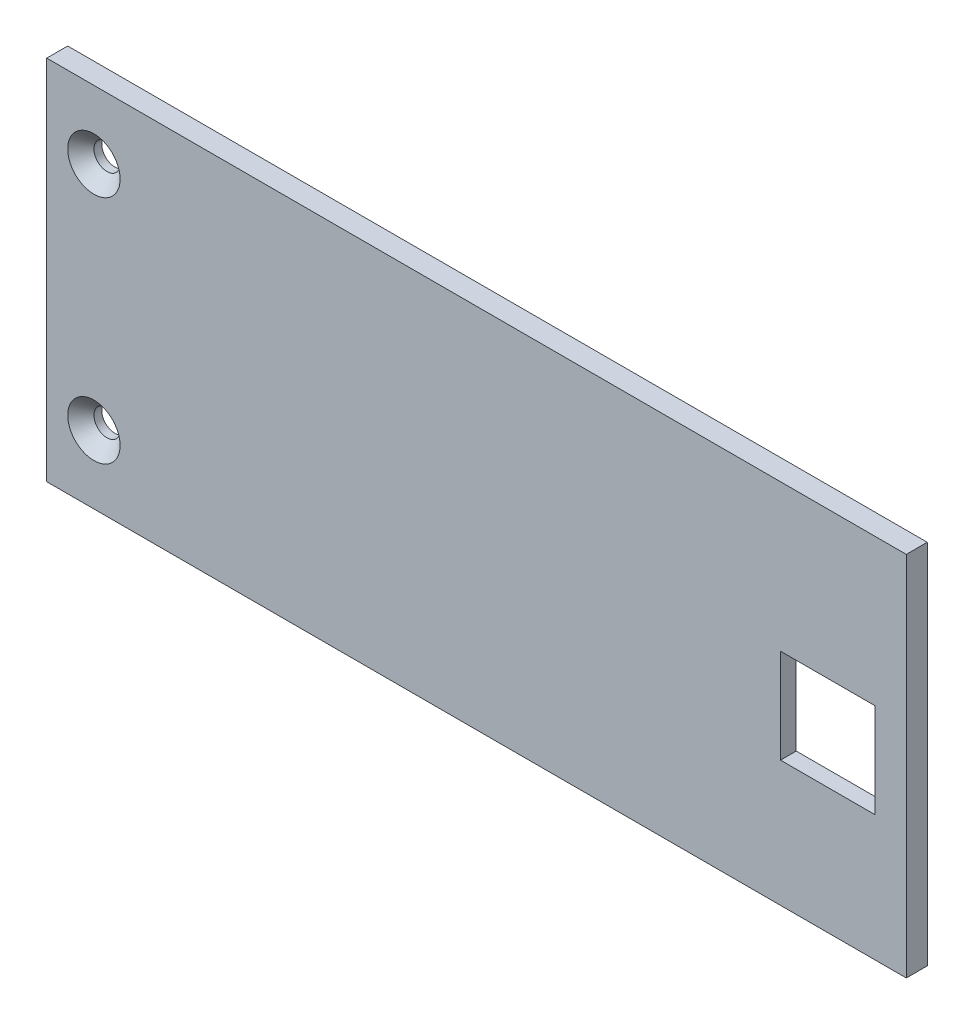
ISO-10303-21;
HEADER;
FILE_DESCRIPTION(('STEP AP214'),'2;1');
FILE_NAME('part.step','',(''),(''),'','','');
FILE_SCHEMA(('AUTOMOTIVE_DESIGN { 1 0 10303 214 1 1 1 1 }'));
ENDSEC;
DATA;
#1=APPLICATION_CONTEXT('core data for automotive mechanical design processes');
#2=APPLICATION_PROTOCOL_DEFINITION('international standard','automotive_design',2000,#1);
#3=PRODUCT_CONTEXT('',#1,'mechanical');
#4=PRODUCT('Part','Part','',(#3));
#5=PRODUCT_RELATED_PRODUCT_CATEGORY('part','',(#4));
#6=PRODUCT_DEFINITION_FORMATION('','',#4);
#7=PRODUCT_DEFINITION_CONTEXT('part definition',#1,'design');
#8=PRODUCT_DEFINITION('design','',#6,#7);
#9=PRODUCT_DEFINITION_SHAPE('','',#8);
#10=(LENGTH_UNIT() NAMED_UNIT(*) SI_UNIT(.MILLI.,.METRE.));
#11=(NAMED_UNIT(*) PLANE_ANGLE_UNIT() SI_UNIT($,.RADIAN.));
#12=(NAMED_UNIT(*) SI_UNIT($,.STERADIAN.) SOLID_ANGLE_UNIT());
#13=UNCERTAINTY_MEASURE_WITH_UNIT(LENGTH_MEASURE(1.E-05),#10,'distance_accuracy_value','');
#14=(GEOMETRIC_REPRESENTATION_CONTEXT(3) GLOBAL_UNCERTAINTY_ASSIGNED_CONTEXT((#13)) GLOBAL_UNIT_ASSIGNED_CONTEXT((#10,
#11,#12)) REPRESENTATION_CONTEXT('',''));
#15=CARTESIAN_POINT('',(0.,0.,0.));
#16=DIRECTION('',(0.,0.,1.));
#17=DIRECTION('',(1.,0.,0.));
#18=AXIS2_PLACEMENT_3D('',#15,#16,#17);
#19=CARTESIAN_POINT('',(-12.,12.,2.));
#20=DIRECTION('',(0.,1.,0.));
#21=DIRECTION('',(0.,0.,1.));
#22=AXIS2_PLACEMENT_3D('',#19,#20,#21);
#23=PLANE('',#22);
#24=DIRECTION('',(0.,0.,-1.));
#25=VECTOR('',#24,1.);
#26=CARTESIAN_POINT('',(-3.,12.,2.));
#27=LINE('',#26,#25);
#28=CARTESIAN_POINT('',(-3.,12.,2.));
#29=VERTEX_POINT('',#28);
#30=CARTESIAN_POINT('',(-3.,12.,0.5));
#31=VERTEX_POINT('',#30);
#32=EDGE_CURVE('E182',#29,#31,#27,.T.);
#33=ORIENTED_EDGE('',*,*,#32,.T.);
#34=DIRECTION('',(-1.,0.,0.));
#35=VECTOR('',#34,1.);
#36=CARTESIAN_POINT('',(-12.,12.,0.5));
#37=LINE('',#36,#35);
#38=CARTESIAN_POINT('',(-12.,12.,0.5));
#39=VERTEX_POINT('',#38);
#40=EDGE_CURVE('E158',#31,#39,#37,.T.);
#41=ORIENTED_EDGE('',*,*,#40,.T.);
#42=DIRECTION('',(0.,0.,-1.));
#43=VECTOR('',#42,1.);
#44=CARTESIAN_POINT('',(-12.,12.,2.));
#45=LINE('',#44,#43);
#46=CARTESIAN_POINT('',(-12.,12.,2.));
#47=VERTEX_POINT('',#46);
#48=EDGE_CURVE('E185',#47,#39,#45,.T.);
#49=ORIENTED_EDGE('',*,*,#48,.F.);
#50=DIRECTION('',(1.,0.,0.));
#51=VECTOR('',#50,1.);
#52=CARTESIAN_POINT('',(-12.,12.,2.));
#53=LINE('',#52,#51);
#54=EDGE_CURVE('E169',#47,#29,#53,.T.);
#55=ORIENTED_EDGE('',*,*,#54,.T.);
#56=EDGE_LOOP('',(#33,#41,#49,#55));
#57=FACE_BOUND('',#56,.T.);
#58=ADVANCED_FACE('F26',(#57),#23,.T.);
#59=CARTESIAN_POINT('',(-3.,21.,2.));
#60=DIRECTION('',(-1.,0.,0.));
#61=DIRECTION('',(0.,-1.,0.));
#62=AXIS2_PLACEMENT_3D('',#59,#60,#61);
#63=PLANE('',#62);
#64=DIRECTION('',(0.,0.,-1.));
#65=VECTOR('',#64,1.);
#66=CARTESIAN_POINT('',(-3.,21.,2.));
#67=LINE('',#66,#65);
#68=CARTESIAN_POINT('',(-3.,21.,2.));
#69=VERTEX_POINT('',#68);
#70=CARTESIAN_POINT('',(-3.,21.,0.5));
#71=VERTEX_POINT('',#70);
#72=EDGE_CURVE('E179',#69,#71,#67,.T.);
#73=ORIENTED_EDGE('',*,*,#72,.T.);
#74=DIRECTION('',(0.,-1.,0.));
#75=VECTOR('',#74,1.);
#76=CARTESIAN_POINT('',(-3.,21.,0.5));
#77=LINE('',#76,#75);
#78=EDGE_CURVE('E155',#71,#31,#77,.T.);
#79=ORIENTED_EDGE('',*,*,#78,.T.);
#80=ORIENTED_EDGE('',*,*,#32,.F.);
#81=DIRECTION('',(0.,1.,0.));
#82=VECTOR('',#81,1.);
#83=CARTESIAN_POINT('',(-3.,21.,2.));
#84=LINE('',#83,#82);
#85=EDGE_CURVE('E171',#29,#69,#84,.T.);
#86=ORIENTED_EDGE('',*,*,#85,.T.);
#87=EDGE_LOOP('',(#73,#79,#80,#86));
#88=FACE_BOUND('',#87,.T.);
#89=ADVANCED_FACE('F249',(#88),#63,.T.);
#90=CARTESIAN_POINT('',(-12.,21.,2.));
#91=DIRECTION('',(0.,-1.,0.));
#92=DIRECTION('',(1.,0.,0.));
#93=AXIS2_PLACEMENT_3D('',#90,#91,#92);
#94=PLANE('',#93);
#95=DIRECTION('',(0.,0.,-1.));
#96=VECTOR('',#95,1.);
#97=CARTESIAN_POINT('',(-12.,21.,2.));
#98=LINE('',#97,#96);
#99=CARTESIAN_POINT('',(-12.,21.,2.));
#100=VERTEX_POINT('',#99);
#101=CARTESIAN_POINT('',(-12.,21.,0.5));
#102=VERTEX_POINT('',#101);
#103=EDGE_CURVE('E176',#100,#102,#98,.T.);
#104=ORIENTED_EDGE('',*,*,#103,.T.);
#105=DIRECTION('',(1.,0.,0.));
#106=VECTOR('',#105,1.);
#107=CARTESIAN_POINT('',(-12.,21.,0.5));
#108=LINE('',#107,#106);
#109=EDGE_CURVE('E49',#102,#71,#108,.T.);
#110=ORIENTED_EDGE('',*,*,#109,.T.);
#111=ORIENTED_EDGE('',*,*,#72,.F.);
#112=DIRECTION('',(-1.,0.,0.));
#113=VECTOR('',#112,1.);
#114=CARTESIAN_POINT('',(-12.,21.,2.));
#115=LINE('',#114,#113);
#116=EDGE_CURVE('E173',#69,#100,#115,.T.);
#117=ORIENTED_EDGE('',*,*,#116,.T.);
#118=EDGE_LOOP('',(#104,#110,#111,#117));
#119=FACE_BOUND('',#118,.T.);
#120=ADVANCED_FACE('F255',(#119),#94,.T.);
#121=CARTESIAN_POINT('',(-12.,21.,2.));
#122=DIRECTION('',(1.,0.,0.));
#123=DIRECTION('',(0.,1.,0.));
#124=AXIS2_PLACEMENT_3D('',#121,#122,#123);
#125=PLANE('',#124);
#126=ORIENTED_EDGE('',*,*,#48,.T.);
#127=DIRECTION('',(0.,1.,0.));
#128=VECTOR('',#127,1.);
#129=CARTESIAN_POINT('',(-12.,21.,0.5));
#130=LINE('',#129,#128);
#131=EDGE_CURVE('E11',#39,#102,#130,.T.);
#132=ORIENTED_EDGE('',*,*,#131,.T.);
#133=ORIENTED_EDGE('',*,*,#103,.F.);
#134=DIRECTION('',(0.,-1.,0.));
#135=VECTOR('',#134,1.);
#136=CARTESIAN_POINT('',(-12.,16.5,2.));
#137=LINE('',#136,#135);
#138=EDGE_CURVE('E167',#100,#47,#137,.T.);
#139=ORIENTED_EDGE('',*,*,#138,.T.);
#140=EDGE_LOOP('',(#126,#132,#133,#139));
#141=FACE_BOUND('',#140,.T.);
#142=ADVANCED_FACE('F265',(#141),#125,.T.);
#143=CARTESIAN_POINT('',(0.,35.,2.));
#144=DIRECTION('',(0.,0.,1.));
#145=DIRECTION('',(1.,0.,0.));
#146=AXIS2_PLACEMENT_3D('',#143,#144,#145);
#147=PLANE('',#146);
#148=CARTESIAN_POINT('',(-77.5,6.5,2.));
#149=DIRECTION('',(0.,0.,1.));
#150=DIRECTION('',(1.,0.,0.));
#151=AXIS2_PLACEMENT_3D('',#148,#149,#150);
#152=CIRCLE('',#151,2.50000000000002);
#153=CARTESIAN_POINT('',(-75.,6.5,2.));
#154=VERTEX_POINT('',#153);
#155=EDGE_CURVE('E224',#154,#154,#152,.F.);
#156=ORIENTED_EDGE('',*,*,#155,.T.);
#157=EDGE_LOOP('',(#156));
#158=FACE_BOUND('',#157,.T.);
#159=CARTESIAN_POINT('',(-77.5,28.5,2.));
#160=DIRECTION('',(0.,0.,1.));
#161=DIRECTION('',(1.,0.,0.));
#162=AXIS2_PLACEMENT_3D('',#159,#160,#161);
#163=CIRCLE('',#162,2.5);
#164=CARTESIAN_POINT('',(-75.,28.5,2.));
#165=VERTEX_POINT('',#164);
#166=EDGE_CURVE('E221',#165,#165,#163,.F.);
#167=ORIENTED_EDGE('',*,*,#166,.T.);
#168=EDGE_LOOP('',(#167));
#169=FACE_BOUND('',#168,.T.);
#170=DIRECTION('',(0.,1.,0.));
#171=VECTOR('',#170,1.);
#172=CARTESIAN_POINT('',(0.,0.,2.));
#173=LINE('',#172,#171);
#174=CARTESIAN_POINT('',(0.,0.,2.));
#175=VERTEX_POINT('',#174);
#176=CARTESIAN_POINT('',(0.,35.,2.));
#177=VERTEX_POINT('',#176);
#178=EDGE_CURVE('E197',#175,#177,#173,.T.);
#179=ORIENTED_EDGE('',*,*,#178,.T.);
#180=DIRECTION('',(-1.,0.,0.));
#181=VECTOR('',#180,1.);
#182=CARTESIAN_POINT('',(0.,35.,2.));
#183=LINE('',#182,#181);
#184=CARTESIAN_POINT('',(-82.,35.,2.));
#185=VERTEX_POINT('',#184);
#186=EDGE_CURVE('E200',#177,#185,#183,.T.);
#187=ORIENTED_EDGE('',*,*,#186,.T.);
#188=DIRECTION('',(0.,-1.,0.));
#189=VECTOR('',#188,1.);
#190=CARTESIAN_POINT('',(-82.,0.,2.));
#191=LINE('',#190,#189);
#192=CARTESIAN_POINT('',(-82.,0.,2.));
#193=VERTEX_POINT('',#192);
#194=EDGE_CURVE('E202',#185,#193,#191,.T.);
#195=ORIENTED_EDGE('',*,*,#194,.T.);
#196=DIRECTION('',(1.,0.,0.));
#197=VECTOR('',#196,1.);
#198=CARTESIAN_POINT('',(0.,0.,2.));
#199=LINE('',#198,#197);
#200=EDGE_CURVE('E204',#193,#175,#199,.T.);
#201=ORIENTED_EDGE('',*,*,#200,.T.);
#202=EDGE_LOOP('',(#179,#187,#195,#201));
#203=FACE_BOUND('',#202,.T.);
#204=ORIENTED_EDGE('',*,*,#85,.F.);
#205=ORIENTED_EDGE('',*,*,#54,.F.);
#206=ORIENTED_EDGE('',*,*,#138,.F.);
#207=ORIENTED_EDGE('',*,*,#116,.F.);
#208=EDGE_LOOP('',(#204,#205,#206,#207));
#209=FACE_BOUND('',#208,.T.);
#210=ADVANCED_FACE('F262',(#158,#169,#203,#209),#147,.T.);
#211=CARTESIAN_POINT('',(0.,35.,0.));
#212=DIRECTION('',(0.,0.,1.));
#213=DIRECTION('',(1.,0.,0.));
#214=AXIS2_PLACEMENT_3D('',#211,#212,#213);
#215=PLANE('',#214);
#216=DIRECTION('',(-1.,0.,0.));
#217=VECTOR('',#216,1.);
#218=CARTESIAN_POINT('',(-2.5,11.5,0.));
#219=LINE('',#218,#217);
#220=CARTESIAN_POINT('',(-2.5,11.5,0.));
#221=VERTEX_POINT('',#220);
#222=CARTESIAN_POINT('',(-12.5,11.5,0.));
#223=VERTEX_POINT('',#222);
#224=EDGE_CURVE('E129',#221,#223,#219,.T.);
#225=ORIENTED_EDGE('',*,*,#224,.F.);
#226=DIRECTION('',(0.,-1.,0.));
#227=VECTOR('',#226,1.);
#228=CARTESIAN_POINT('',(-2.5,21.5,0.));
#229=LINE('',#228,#227);
#230=CARTESIAN_POINT('',(-2.5,21.5,0.));
#231=VERTEX_POINT('',#230);
#232=EDGE_CURVE('E41',#231,#221,#229,.T.);
#233=ORIENTED_EDGE('',*,*,#232,.F.);
#234=DIRECTION('',(1.,0.,0.));
#235=VECTOR('',#234,1.);
#236=CARTESIAN_POINT('',(-12.5,21.5,0.));
#237=LINE('',#236,#235);
#238=CARTESIAN_POINT('',(-12.5,21.5,0.));
#239=VERTEX_POINT('',#238);
#240=EDGE_CURVE('E136',#239,#231,#237,.T.);
#241=ORIENTED_EDGE('',*,*,#240,.F.);
#242=DIRECTION('',(0.,1.,0.));
#243=VECTOR('',#242,1.);
#244=CARTESIAN_POINT('',(-12.5,11.5,0.));
#245=LINE('',#244,#243);
#246=EDGE_CURVE('E118',#223,#239,#245,.T.);
#247=ORIENTED_EDGE('',*,*,#246,.F.);
#248=EDGE_LOOP('',(#225,#233,#241,#247));
#249=FACE_BOUND('',#248,.T.);
#250=CARTESIAN_POINT('',(-77.5,28.5,0.));
#251=DIRECTION('',(0.,0.,1.));
#252=DIRECTION('',(1.,0.,0.));
#253=AXIS2_PLACEMENT_3D('',#250,#251,#252);
#254=CIRCLE('',#253,1.25);
#255=CARTESIAN_POINT('',(-76.25,28.5,0.));
#256=VERTEX_POINT('',#255);
#257=EDGE_CURVE('E164',#256,#256,#254,.T.);
#258=ORIENTED_EDGE('',*,*,#257,.T.);
#259=EDGE_LOOP('',(#258));
#260=FACE_BOUND('',#259,.T.);
#261=DIRECTION('',(0.,1.,0.));
#262=VECTOR('',#261,1.);
#263=CARTESIAN_POINT('',(0.,0.,0.));
#264=LINE('',#263,#262);
#265=CARTESIAN_POINT('',(0.,0.,0.));
#266=VERTEX_POINT('',#265);
#267=CARTESIAN_POINT('',(0.,35.,0.));
#268=VERTEX_POINT('',#267);
#269=EDGE_CURVE('E188',#266,#268,#264,.T.);
#270=ORIENTED_EDGE('',*,*,#269,.F.);
#271=DIRECTION('',(1.,0.,0.));
#272=VECTOR('',#271,1.);
#273=CARTESIAN_POINT('',(0.,0.,0.));
#274=LINE('',#273,#272);
#275=CARTESIAN_POINT('',(-82.,0.,0.));
#276=VERTEX_POINT('',#275);
#277=EDGE_CURVE('E195',#276,#266,#274,.T.);
#278=ORIENTED_EDGE('',*,*,#277,.F.);
#279=DIRECTION('',(0.,-1.,0.));
#280=VECTOR('',#279,1.);
#281=CARTESIAN_POINT('',(-82.,0.,0.));
#282=LINE('',#281,#280);
#283=CARTESIAN_POINT('',(-82.,35.,0.));
#284=VERTEX_POINT('',#283);
#285=EDGE_CURVE('E193',#284,#276,#282,.T.);
#286=ORIENTED_EDGE('',*,*,#285,.F.);
#287=DIRECTION('',(-1.,0.,0.));
#288=VECTOR('',#287,1.);
#289=CARTESIAN_POINT('',(0.,35.,0.));
#290=LINE('',#289,#288);
#291=EDGE_CURVE('E191',#268,#284,#290,.T.);
#292=ORIENTED_EDGE('',*,*,#291,.F.);
#293=EDGE_LOOP('',(#270,#278,#286,#292));
#294=FACE_BOUND('',#293,.T.);
#295=CARTESIAN_POINT('',(-77.5,6.5,0.));
#296=DIRECTION('',(0.,0.,1.));
#297=DIRECTION('',(1.,0.,0.));
#298=AXIS2_PLACEMENT_3D('',#295,#296,#297);
#299=CIRCLE('',#298,1.25);
#300=CARTESIAN_POINT('',(-76.25,6.5,0.));
#301=VERTEX_POINT('',#300);
#302=EDGE_CURVE('E161',#301,#301,#299,.T.);
#303=ORIENTED_EDGE('',*,*,#302,.T.);
#304=EDGE_LOOP('',(#303));
#305=FACE_BOUND('',#304,.T.);
#306=ADVANCED_FACE('F133',(#249,#260,#294,#305),#215,.F.);
#307=CARTESIAN_POINT('',(0.,0.,2.));
#308=DIRECTION('',(-1.,0.,0.));
#309=DIRECTION('',(0.,0.,1.));
#310=AXIS2_PLACEMENT_3D('',#307,#308,#309);
#311=PLANE('',#310);
#312=ORIENTED_EDGE('',*,*,#269,.T.);
#313=DIRECTION('',(0.,0.,-1.));
#314=VECTOR('',#313,1.);
#315=CARTESIAN_POINT('',(0.,35.,2.));
#316=LINE('',#315,#314);
#317=EDGE_CURVE('E215',#177,#268,#316,.T.);
#318=ORIENTED_EDGE('',*,*,#317,.F.);
#319=ORIENTED_EDGE('',*,*,#178,.F.);
#320=DIRECTION('',(0.,0.,-1.));
#321=VECTOR('',#320,1.);
#322=CARTESIAN_POINT('',(0.,0.,2.));
#323=LINE('',#322,#321);
#324=EDGE_CURVE('E206',#175,#266,#323,.T.);
#325=ORIENTED_EDGE('',*,*,#324,.T.);
#326=EDGE_LOOP('',(#312,#318,#319,#325));
#327=FACE_BOUND('',#326,.T.);
#328=ADVANCED_FACE('F28',(#327),#311,.F.);
#329=CARTESIAN_POINT('',(0.,35.,2.));
#330=DIRECTION('',(0.,-1.,0.));
#331=DIRECTION('',(0.,0.,-1.));
#332=AXIS2_PLACEMENT_3D('',#329,#330,#331);
#333=PLANE('',#332);
#334=ORIENTED_EDGE('',*,*,#291,.T.);
#335=DIRECTION('',(0.,0.,-1.));
#336=VECTOR('',#335,1.);
#337=CARTESIAN_POINT('',(-82.,35.,2.));
#338=LINE('',#337,#336);
#339=EDGE_CURVE('E212',#185,#284,#338,.T.);
#340=ORIENTED_EDGE('',*,*,#339,.F.);
#341=ORIENTED_EDGE('',*,*,#186,.F.);
#342=ORIENTED_EDGE('',*,*,#317,.T.);
#343=EDGE_LOOP('',(#334,#340,#341,#342));
#344=FACE_BOUND('',#343,.T.);
#345=ADVANCED_FACE('F273',(#344),#333,.F.);
#346=CARTESIAN_POINT('',(-82.,0.,2.));
#347=DIRECTION('',(1.,0.,0.));
#348=DIRECTION('',(0.,0.,-1.));
#349=AXIS2_PLACEMENT_3D('',#346,#347,#348);
#350=PLANE('',#349);
#351=ORIENTED_EDGE('',*,*,#285,.T.);
#352=DIRECTION('',(0.,0.,-1.));
#353=VECTOR('',#352,1.);
#354=CARTESIAN_POINT('',(-82.,0.,2.));
#355=LINE('',#354,#353);
#356=EDGE_CURVE('E209',#193,#276,#355,.T.);
#357=ORIENTED_EDGE('',*,*,#356,.F.);
#358=ORIENTED_EDGE('',*,*,#194,.F.);
#359=ORIENTED_EDGE('',*,*,#339,.T.);
#360=EDGE_LOOP('',(#351,#357,#358,#359));
#361=FACE_BOUND('',#360,.T.);
#362=ADVANCED_FACE('F270',(#361),#350,.F.);
#363=CARTESIAN_POINT('',(0.,0.,2.));
#364=DIRECTION('',(0.,1.,0.));
#365=DIRECTION('',(-1.,0.,0.));
#366=AXIS2_PLACEMENT_3D('',#363,#364,#365);
#367=PLANE('',#366);
#368=ORIENTED_EDGE('',*,*,#277,.T.);
#369=ORIENTED_EDGE('',*,*,#324,.F.);
#370=ORIENTED_EDGE('',*,*,#200,.F.);
#371=ORIENTED_EDGE('',*,*,#356,.T.);
#372=EDGE_LOOP('',(#368,#369,#370,#371));
#373=FACE_BOUND('',#372,.T.);
#374=ADVANCED_FACE('F267',(#373),#367,.F.);
#375=CARTESIAN_POINT('',(-77.5,28.5,2.));
#376=DIRECTION('',(0.,0.,-1.));
#377=DIRECTION('',(-1.,0.,0.));
#378=AXIS2_PLACEMENT_3D('',#375,#376,#377);
#379=CYLINDRICAL_SURFACE('',#378,1.25);
#380=CARTESIAN_POINT('',(-77.5,28.5,0.750000000000005));
#381=DIRECTION('',(0.,0.,1.));
#382=DIRECTION('',(1.,0.,0.));
#383=AXIS2_PLACEMENT_3D('',#380,#381,#382);
#384=CIRCLE('',#383,1.25);
#385=CARTESIAN_POINT('',(-76.25,28.5,0.750000000000005));
#386=VERTEX_POINT('',#385);
#387=EDGE_CURVE('E34',#386,#386,#384,.T.);
#388=ORIENTED_EDGE('',*,*,#387,.T.);
#389=EDGE_LOOP('',(#388));
#390=FACE_BOUND('',#389,.T.);
#391=ORIENTED_EDGE('',*,*,#257,.F.);
#392=EDGE_LOOP('',(#391));
#393=FACE_BOUND('',#392,.T.);
#394=ADVANCED_FACE('F229',(#390,#393),#379,.F.);
#395=CARTESIAN_POINT('',(-77.5,6.5,2.));
#396=DIRECTION('',(0.,0.,-1.));
#397=DIRECTION('',(-1.,0.,0.));
#398=AXIS2_PLACEMENT_3D('',#395,#396,#397);
#399=CYLINDRICAL_SURFACE('',#398,1.25);
#400=CARTESIAN_POINT('',(-77.5,6.5,0.749999999999991));
#401=DIRECTION('',(0.,0.,1.));
#402=DIRECTION('',(1.,0.,0.));
#403=AXIS2_PLACEMENT_3D('',#400,#401,#402);
#404=CIRCLE('',#403,1.25);
#405=CARTESIAN_POINT('',(-76.25,6.5,0.749999999999991));
#406=VERTEX_POINT('',#405);
#407=EDGE_CURVE('E218',#406,#406,#404,.T.);
#408=ORIENTED_EDGE('',*,*,#407,.T.);
#409=EDGE_LOOP('',(#408));
#410=FACE_BOUND('',#409,.T.);
#411=ORIENTED_EDGE('',*,*,#302,.F.);
#412=EDGE_LOOP('',(#411));
#413=FACE_BOUND('',#412,.T.);
#414=ADVANCED_FACE('F245',(#410,#413),#399,.F.);
#415=CARTESIAN_POINT('',(-77.5,6.5,0.749999999999991));
#416=DIRECTION('',(0.,0.,1.));
#417=DIRECTION('',(1.,0.,0.));
#418=AXIS2_PLACEMENT_3D('',#415,#416,#417);
#419=CONICAL_SURFACE('',#418,1.25,0.785398163397452);
#420=ORIENTED_EDGE('',*,*,#155,.F.);
#421=EDGE_LOOP('',(#420));
#422=FACE_BOUND('',#421,.T.);
#423=ORIENTED_EDGE('',*,*,#407,.F.);
#424=EDGE_LOOP('',(#423));
#425=FACE_BOUND('',#424,.T.);
#426=ADVANCED_FACE('F235',(#422,#425),#419,.F.);
#427=CARTESIAN_POINT('',(-77.5,28.5,0.750000000000005));
#428=DIRECTION('',(0.,0.,1.));
#429=DIRECTION('',(1.,0.,0.));
#430=AXIS2_PLACEMENT_3D('',#427,#428,#429);
#431=CONICAL_SURFACE('',#430,1.25,0.785398163397452);
#432=ORIENTED_EDGE('',*,*,#166,.F.);
#433=EDGE_LOOP('',(#432));
#434=FACE_BOUND('',#433,.T.);
#435=ORIENTED_EDGE('',*,*,#387,.F.);
#436=EDGE_LOOP('',(#435));
#437=FACE_BOUND('',#436,.T.);
#438=ADVANCED_FACE('F232',(#434,#437),#431,.F.);
#439=CARTESIAN_POINT('',(-2.5,21.5,0.5));
#440=DIRECTION('',(1.,0.,0.));
#441=DIRECTION('',(0.,1.,0.));
#442=AXIS2_PLACEMENT_3D('',#439,#440,#441);
#443=PLANE('',#442);
#444=ORIENTED_EDGE('',*,*,#232,.T.);
#445=DIRECTION('',(0.,0.,-1.));
#446=VECTOR('',#445,1.);
#447=CARTESIAN_POINT('',(-2.5,11.5,0.5));
#448=LINE('',#447,#446);
#449=CARTESIAN_POINT('',(-2.5,11.5,0.5));
#450=VERTEX_POINT('',#449);
#451=EDGE_CURVE('E126',#450,#221,#448,.T.);
#452=ORIENTED_EDGE('',*,*,#451,.F.);
#453=DIRECTION('',(0.,-1.,0.));
#454=VECTOR('',#453,1.);
#455=CARTESIAN_POINT('',(-2.5,21.5,0.5));
#456=LINE('',#455,#454);
#457=CARTESIAN_POINT('',(-2.5,21.5,0.5));
#458=VERTEX_POINT('',#457);
#459=EDGE_CURVE('E138',#458,#450,#456,.T.);
#460=ORIENTED_EDGE('',*,*,#459,.F.);
#461=DIRECTION('',(0.,0.,-1.));
#462=VECTOR('',#461,1.);
#463=CARTESIAN_POINT('',(-2.5,21.5,0.5));
#464=LINE('',#463,#462);
#465=EDGE_CURVE('E150',#458,#231,#464,.T.);
#466=ORIENTED_EDGE('',*,*,#465,.T.);
#467=EDGE_LOOP('',(#444,#452,#460,#466));
#468=FACE_BOUND('',#467,.T.);
#469=ADVANCED_FACE('F234',(#468),#443,.F.);
#470=CARTESIAN_POINT('',(-12.5,21.5,0.5));
#471=DIRECTION('',(0.,1.,0.));
#472=DIRECTION('',(-1.,0.,0.));
#473=AXIS2_PLACEMENT_3D('',#470,#471,#472);
#474=PLANE('',#473);
#475=ORIENTED_EDGE('',*,*,#240,.T.);
#476=ORIENTED_EDGE('',*,*,#465,.F.);
#477=DIRECTION('',(1.,0.,0.));
#478=VECTOR('',#477,1.);
#479=CARTESIAN_POINT('',(-12.5,21.5,0.5));
#480=LINE('',#479,#478);
#481=CARTESIAN_POINT('',(-12.5,21.5,0.5));
#482=VERTEX_POINT('',#481);
#483=EDGE_CURVE('E147',#482,#458,#480,.T.);
#484=ORIENTED_EDGE('',*,*,#483,.F.);
#485=DIRECTION('',(0.,0.,-1.));
#486=VECTOR('',#485,1.);
#487=CARTESIAN_POINT('',(-12.5,21.5,0.5));
#488=LINE('',#487,#486);
#489=EDGE_CURVE('E125',#482,#239,#488,.T.);
#490=ORIENTED_EDGE('',*,*,#489,.T.);
#491=EDGE_LOOP('',(#475,#476,#484,#490));
#492=FACE_BOUND('',#491,.T.);
#493=ADVANCED_FACE('F243',(#492),#474,.F.);
#494=CARTESIAN_POINT('',(-12.5,11.5,0.5));
#495=DIRECTION('',(-1.,0.,0.));
#496=DIRECTION('',(0.,-1.,0.));
#497=AXIS2_PLACEMENT_3D('',#494,#495,#496);
#498=PLANE('',#497);
#499=ORIENTED_EDGE('',*,*,#246,.T.);
#500=ORIENTED_EDGE('',*,*,#489,.F.);
#501=DIRECTION('',(0.,1.,0.));
#502=VECTOR('',#501,1.);
#503=CARTESIAN_POINT('',(-12.5,11.5,0.5));
#504=LINE('',#503,#502);
#505=CARTESIAN_POINT('',(-12.5,11.5,0.5));
#506=VERTEX_POINT('',#505);
#507=EDGE_CURVE('E121',#506,#482,#504,.T.);
#508=ORIENTED_EDGE('',*,*,#507,.F.);
#509=DIRECTION('',(0.,0.,-1.));
#510=VECTOR('',#509,1.);
#511=CARTESIAN_POINT('',(-12.5,11.5,0.5));
#512=LINE('',#511,#510);
#513=EDGE_CURVE('E114',#506,#223,#512,.T.);
#514=ORIENTED_EDGE('',*,*,#513,.T.);
#515=EDGE_LOOP('',(#499,#500,#508,#514));
#516=FACE_BOUND('',#515,.T.);
#517=ADVANCED_FACE('F116',(#516),#498,.F.);
#518=CARTESIAN_POINT('',(-2.5,11.5,0.5));
#519=DIRECTION('',(0.,-1.,0.));
#520=DIRECTION('',(0.,0.,-1.));
#521=AXIS2_PLACEMENT_3D('',#518,#519,#520);
#522=PLANE('',#521);
#523=ORIENTED_EDGE('',*,*,#224,.T.);
#524=ORIENTED_EDGE('',*,*,#513,.F.);
#525=DIRECTION('',(-1.,0.,0.));
#526=VECTOR('',#525,1.);
#527=CARTESIAN_POINT('',(-2.5,11.5,0.5));
#528=LINE('',#527,#526);
#529=EDGE_CURVE('E144',#450,#506,#528,.T.);
#530=ORIENTED_EDGE('',*,*,#529,.F.);
#531=ORIENTED_EDGE('',*,*,#451,.T.);
#532=EDGE_LOOP('',(#523,#524,#530,#531));
#533=FACE_BOUND('',#532,.T.);
#534=ADVANCED_FACE('F130',(#533),#522,.F.);
#535=CARTESIAN_POINT('',(-2.5,11.5,0.5));
#536=DIRECTION('',(0.,0.,-1.));
#537=DIRECTION('',(-1.,0.,0.));
#538=AXIS2_PLACEMENT_3D('',#535,#536,#537);
#539=PLANE('',#538);
#540=ORIENTED_EDGE('',*,*,#78,.F.);
#541=ORIENTED_EDGE('',*,*,#109,.F.);
#542=ORIENTED_EDGE('',*,*,#131,.F.);
#543=ORIENTED_EDGE('',*,*,#40,.F.);
#544=EDGE_LOOP('',(#540,#541,#542,#543));
#545=FACE_BOUND('',#544,.T.);
#546=ORIENTED_EDGE('',*,*,#459,.T.);
#547=ORIENTED_EDGE('',*,*,#529,.T.);
#548=ORIENTED_EDGE('',*,*,#507,.T.);
#549=ORIENTED_EDGE('',*,*,#483,.T.);
#550=EDGE_LOOP('',(#546,#547,#548,#549));
#551=FACE_BOUND('',#550,.T.);
#552=ADVANCED_FACE('F304',(#545,#551),#539,.T.);
#553=CLOSED_SHELL('',(#58,#89,#120,#142,#210,#306,#328,#345,#362,#374,#394,#414,#426,#438,#469,
#493,#517,#534,#552));
#554=MANIFOLD_SOLID_BREP('B2',#553);
#555=ADVANCED_BREP_SHAPE_REPRESENTATION('',(#18,#554),#14);
#556=SHAPE_DEFINITION_REPRESENTATION(#9,#555);
ENDSEC;
END-ISO-10303-21;
